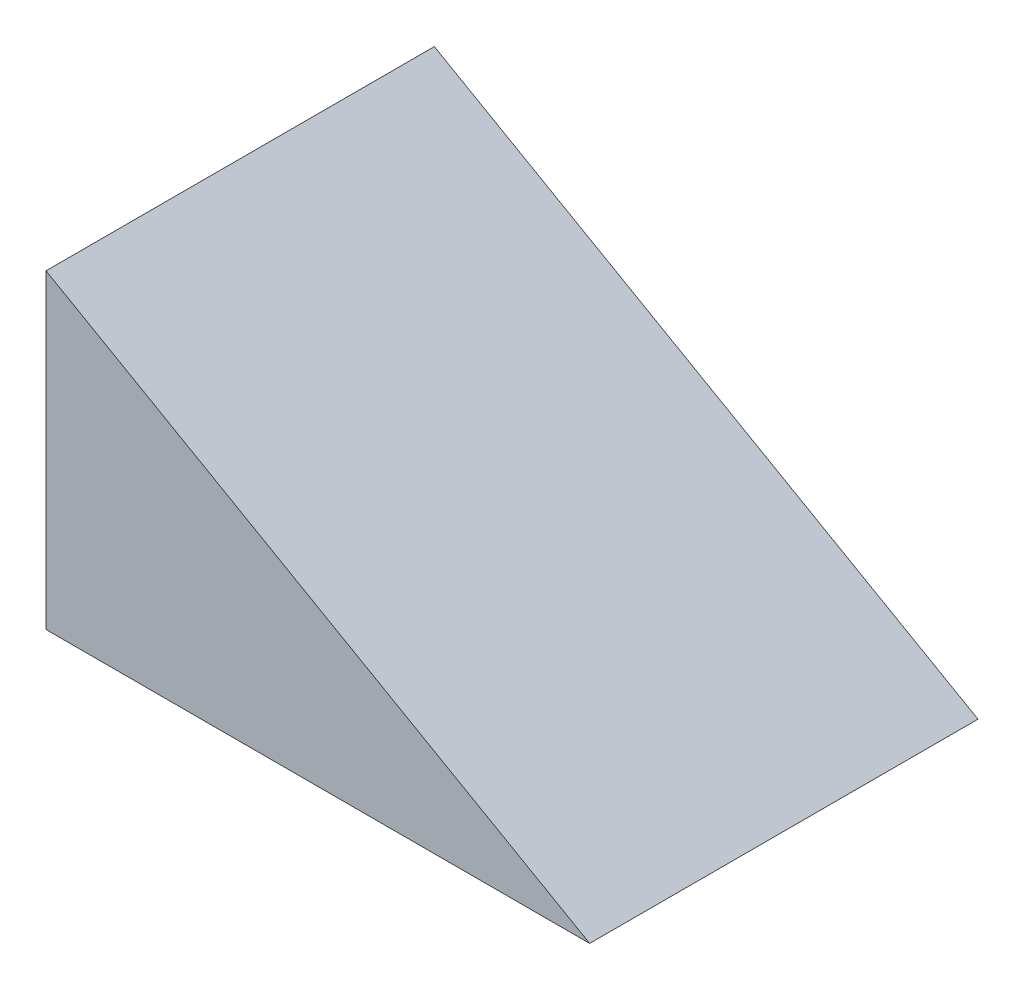
ISO-10303-21;
HEADER;
FILE_DESCRIPTION(('STEP AP214'),'2;1');
FILE_NAME('part.step','',(''),(''),'','','');
FILE_SCHEMA(('AUTOMOTIVE_DESIGN { 1 0 10303 214 1 1 1 1 }'));
ENDSEC;
DATA;
#1=APPLICATION_CONTEXT('core data for automotive mechanical design processes');
#2=APPLICATION_PROTOCOL_DEFINITION('international standard','automotive_design',2000,#1);
#3=PRODUCT_CONTEXT('',#1,'mechanical');
#4=PRODUCT('Part','Part','',(#3));
#5=PRODUCT_RELATED_PRODUCT_CATEGORY('part','',(#4));
#6=PRODUCT_DEFINITION_FORMATION('','',#4);
#7=PRODUCT_DEFINITION_CONTEXT('part definition',#1,'design');
#8=PRODUCT_DEFINITION('design','',#6,#7);
#9=PRODUCT_DEFINITION_SHAPE('','',#8);
#10=(LENGTH_UNIT() NAMED_UNIT(*) SI_UNIT(.MILLI.,.METRE.));
#11=(NAMED_UNIT(*) PLANE_ANGLE_UNIT() SI_UNIT($,.RADIAN.));
#12=(NAMED_UNIT(*) SI_UNIT($,.STERADIAN.) SOLID_ANGLE_UNIT());
#13=UNCERTAINTY_MEASURE_WITH_UNIT(LENGTH_MEASURE(1.E-05),#10,'distance_accuracy_value','');
#14=(GEOMETRIC_REPRESENTATION_CONTEXT(3) GLOBAL_UNCERTAINTY_ASSIGNED_CONTEXT((#13)) GLOBAL_UNIT_ASSIGNED_CONTEXT((#10,
#11,#12)) REPRESENTATION_CONTEXT('',''));
#15=CARTESIAN_POINT('',(0.,0.,0.));
#16=DIRECTION('',(0.,0.,1.));
#17=DIRECTION('',(1.,0.,0.));
#18=AXIS2_PLACEMENT_3D('',#15,#16,#17);
#19=CARTESIAN_POINT('',(0.,40.,50.));
#20=DIRECTION('',(1.,0.,0.));
#21=DIRECTION('',(0.,0.,-1.));
#22=AXIS2_PLACEMENT_3D('',#19,#20,#21);
#23=PLANE('',#22);
#24=DIRECTION('',(0.,-1.,0.));
#25=VECTOR('',#24,1.);
#26=CARTESIAN_POINT('',(0.,40.,0.));
#27=LINE('',#26,#25);
#28=CARTESIAN_POINT('',(0.,40.,0.));
#29=VERTEX_POINT('',#28);
#30=CARTESIAN_POINT('',(0.,0.,0.));
#31=VERTEX_POINT('',#30);
#32=EDGE_CURVE('E80',#29,#31,#27,.T.);
#33=ORIENTED_EDGE('',*,*,#32,.T.);
#34=DIRECTION('',(0.,0.,-1.));
#35=VECTOR('',#34,1.);
#36=CARTESIAN_POINT('',(0.,0.,50.));
#37=LINE('',#36,#35);
#38=CARTESIAN_POINT('',(0.,0.,50.));
#39=VERTEX_POINT('',#38);
#40=EDGE_CURVE('E11',#39,#31,#37,.T.);
#41=ORIENTED_EDGE('',*,*,#40,.F.);
#42=DIRECTION('',(0.,-1.,0.));
#43=VECTOR('',#42,1.);
#44=CARTESIAN_POINT('',(0.,40.,50.));
#45=LINE('',#44,#43);
#46=CARTESIAN_POINT('',(0.,40.,50.));
#47=VERTEX_POINT('',#46);
#48=EDGE_CURVE('E73',#47,#39,#45,.T.);
#49=ORIENTED_EDGE('',*,*,#48,.F.);
#50=DIRECTION('',(0.,0.,-1.));
#51=VECTOR('',#50,1.);
#52=CARTESIAN_POINT('',(0.,40.,50.));
#53=LINE('',#52,#51);
#54=EDGE_CURVE('E81',#47,#29,#53,.T.);
#55=ORIENTED_EDGE('',*,*,#54,.T.);
#56=EDGE_LOOP('',(#33,#41,#49,#55));
#57=FACE_BOUND('',#56,.T.);
#58=ADVANCED_FACE('F33',(#57),#23,.F.);
#59=CARTESIAN_POINT('',(0.,0.,50.));
#60=DIRECTION('',(0.,1.,0.));
#61=DIRECTION('',(0.,0.,1.));
#62=AXIS2_PLACEMENT_3D('',#59,#60,#61);
#63=PLANE('',#62);
#64=DIRECTION('',(1.,0.,0.));
#65=VECTOR('',#64,1.);
#66=CARTESIAN_POINT('',(0.,0.,0.));
#67=LINE('',#66,#65);
#68=CARTESIAN_POINT('',(70.,0.,0.));
#69=VERTEX_POINT('',#68);
#70=EDGE_CURVE('E61',#31,#69,#67,.T.);
#71=ORIENTED_EDGE('',*,*,#70,.T.);
#72=DIRECTION('',(0.,0.,-1.));
#73=VECTOR('',#72,1.);
#74=CARTESIAN_POINT('',(70.,0.,50.));
#75=LINE('',#74,#73);
#76=CARTESIAN_POINT('',(70.,0.,50.));
#77=VERTEX_POINT('',#76);
#78=EDGE_CURVE('E41',#77,#69,#75,.T.);
#79=ORIENTED_EDGE('',*,*,#78,.F.);
#80=DIRECTION('',(1.,0.,0.));
#81=VECTOR('',#80,1.);
#82=CARTESIAN_POINT('',(0.,0.,50.));
#83=LINE('',#82,#81);
#84=EDGE_CURVE('E69',#39,#77,#83,.T.);
#85=ORIENTED_EDGE('',*,*,#84,.F.);
#86=ORIENTED_EDGE('',*,*,#40,.T.);
#87=EDGE_LOOP('',(#71,#79,#85,#86));
#88=FACE_BOUND('',#87,.T.);
#89=ADVANCED_FACE('F70',(#88),#63,.F.);
#90=CARTESIAN_POINT('',(70.,0.,50.));
#91=DIRECTION('',(-0.496138938356834,-0.868243142124459,0.));
#92=DIRECTION('',(0.868243142124459,-0.496138938356834,0.));
#93=AXIS2_PLACEMENT_3D('',#90,#91,#92);
#94=PLANE('',#93);
#95=DIRECTION('',(-0.868243142124459,0.496138938356834,0.));
#96=VECTOR('',#95,1.);
#97=CARTESIAN_POINT('',(70.,0.,0.));
#98=LINE('',#97,#96);
#99=EDGE_CURVE('E66',#69,#29,#98,.T.);
#100=ORIENTED_EDGE('',*,*,#99,.T.);
#101=ORIENTED_EDGE('',*,*,#54,.F.);
#102=DIRECTION('',(-0.868243142124459,0.496138938356834,0.));
#103=VECTOR('',#102,1.);
#104=CARTESIAN_POINT('',(70.,0.,50.));
#105=LINE('',#104,#103);
#106=EDGE_CURVE('E49',#77,#47,#105,.T.);
#107=ORIENTED_EDGE('',*,*,#106,.F.);
#108=ORIENTED_EDGE('',*,*,#78,.T.);
#109=EDGE_LOOP('',(#100,#101,#107,#108));
#110=FACE_BOUND('',#109,.T.);
#111=ADVANCED_FACE('F88',(#110),#94,.F.);
#112=CARTESIAN_POINT('',(0.,0.,50.));
#113=DIRECTION('',(0.,0.,1.));
#114=DIRECTION('',(1.,0.,0.));
#115=AXIS2_PLACEMENT_3D('',#112,#113,#114);
#116=PLANE('',#115);
#117=ORIENTED_EDGE('',*,*,#48,.T.);
#118=ORIENTED_EDGE('',*,*,#84,.T.);
#119=ORIENTED_EDGE('',*,*,#106,.T.);
#120=EDGE_LOOP('',(#117,#118,#119));
#121=FACE_BOUND('',#120,.T.);
#122=ADVANCED_FACE('F76',(#121),#116,.T.);
#123=CARTESIAN_POINT('',(0.,0.,0.));
#124=DIRECTION('',(0.,0.,1.));
#125=DIRECTION('',(1.,0.,0.));
#126=AXIS2_PLACEMENT_3D('',#123,#124,#125);
#127=PLANE('',#126);
#128=ORIENTED_EDGE('',*,*,#32,.F.);
#129=ORIENTED_EDGE('',*,*,#99,.F.);
#130=ORIENTED_EDGE('',*,*,#70,.F.);
#131=EDGE_LOOP('',(#128,#129,#130));
#132=FACE_BOUND('',#131,.T.);
#133=ADVANCED_FACE('F89',(#132),#127,.F.);
#134=CLOSED_SHELL('',(#58,#89,#111,#122,#133));
#135=MANIFOLD_SOLID_BREP('B2',#134);
#136=ADVANCED_BREP_SHAPE_REPRESENTATION('',(#18,#135),#14);
#137=SHAPE_DEFINITION_REPRESENTATION(#9,#136);
ENDSEC;
END-ISO-10303-21;
